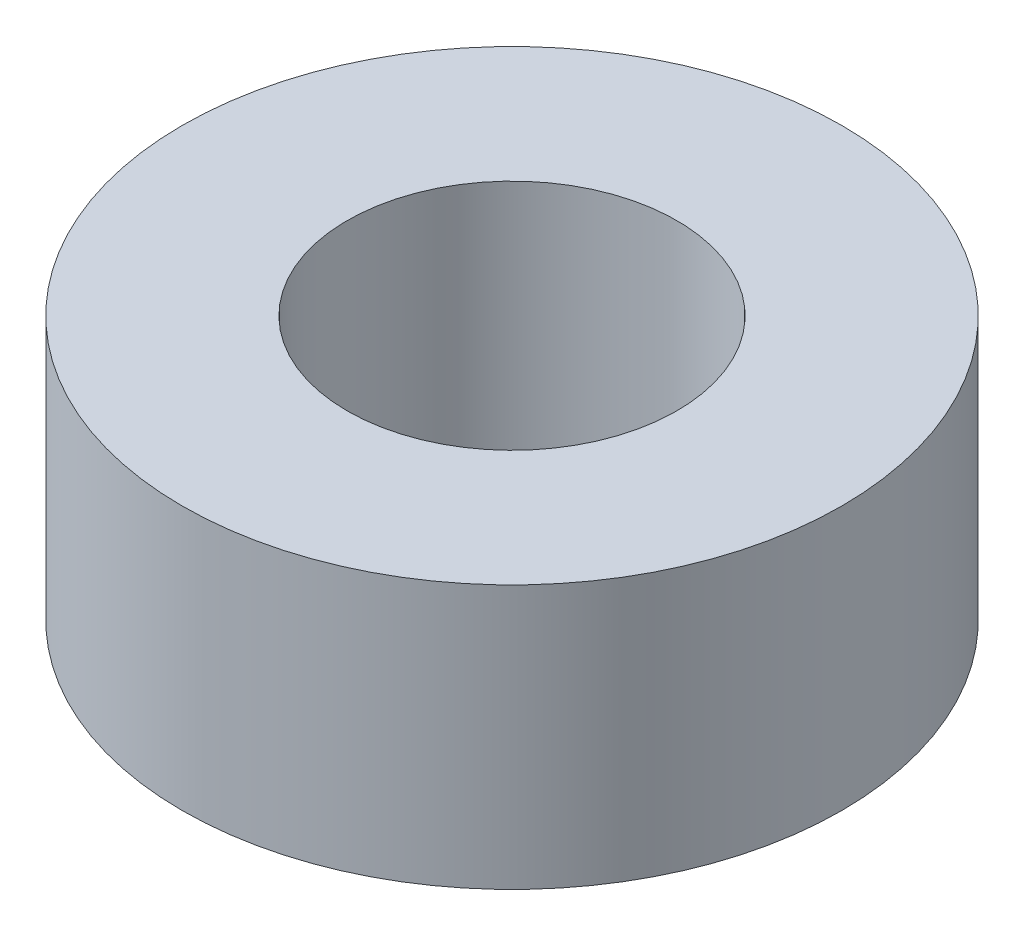
ISO-10303-21;
HEADER;
FILE_DESCRIPTION(('STEP AP214'),'2;1');
FILE_NAME('part.step','',(''),(''),'','','');
FILE_SCHEMA(('AUTOMOTIVE_DESIGN { 1 0 10303 214 1 1 1 1 }'));
ENDSEC;
DATA;
#1=APPLICATION_CONTEXT('core data for automotive mechanical design processes');
#2=APPLICATION_PROTOCOL_DEFINITION('international standard','automotive_design',2000,#1);
#3=PRODUCT_CONTEXT('',#1,'mechanical');
#4=PRODUCT('Part','Part','',(#3));
#5=PRODUCT_RELATED_PRODUCT_CATEGORY('part','',(#4));
#6=PRODUCT_DEFINITION_FORMATION('','',#4);
#7=PRODUCT_DEFINITION_CONTEXT('part definition',#1,'design');
#8=PRODUCT_DEFINITION('design','',#6,#7);
#9=PRODUCT_DEFINITION_SHAPE('','',#8);
#10=(LENGTH_UNIT() NAMED_UNIT(*) SI_UNIT(.MILLI.,.METRE.));
#11=(NAMED_UNIT(*) PLANE_ANGLE_UNIT() SI_UNIT($,.RADIAN.));
#12=(NAMED_UNIT(*) SI_UNIT($,.STERADIAN.) SOLID_ANGLE_UNIT());
#13=UNCERTAINTY_MEASURE_WITH_UNIT(LENGTH_MEASURE(1.E-05),#10,'distance_accuracy_value','');
#14=(GEOMETRIC_REPRESENTATION_CONTEXT(3) GLOBAL_UNCERTAINTY_ASSIGNED_CONTEXT((#13)) GLOBAL_UNIT_ASSIGNED_CONTEXT((#10,
#11,#12)) REPRESENTATION_CONTEXT('',''));
#15=CARTESIAN_POINT('',(0.,0.,0.));
#16=DIRECTION('',(0.,0.,1.));
#17=DIRECTION('',(1.,0.,0.));
#18=AXIS2_PLACEMENT_3D('',#15,#16,#17);
#19=CARTESIAN_POINT('',(0.,4.,0.));
#20=DIRECTION('',(0.,1.,0.));
#21=DIRECTION('',(0.,0.,1.));
#22=AXIS2_PLACEMENT_3D('',#19,#20,#21);
#23=PLANE('',#22);
#24=CARTESIAN_POINT('',(0.,4.,0.));
#25=DIRECTION('',(0.,1.,0.));
#26=DIRECTION('',(0.,0.,1.));
#27=AXIS2_PLACEMENT_3D('',#24,#25,#26);
#28=CIRCLE('',#27,5.);
#29=CARTESIAN_POINT('',(0.,4.,5.));
#30=VERTEX_POINT('',#29);
#31=EDGE_CURVE('E10',#30,#30,#28,.T.);
#32=ORIENTED_EDGE('',*,*,#31,.T.);
#33=EDGE_LOOP('',(#32));
#34=FACE_BOUND('',#33,.T.);
#35=CARTESIAN_POINT('',(0.,4.,0.));
#36=DIRECTION('',(0.,1.,0.));
#37=DIRECTION('',(0.,0.,1.));
#38=AXIS2_PLACEMENT_3D('',#35,#36,#37);
#39=CIRCLE('',#38,2.5);
#40=CARTESIAN_POINT('',(0.,4.,2.5));
#41=VERTEX_POINT('',#40);
#42=EDGE_CURVE('E42',#41,#41,#39,.T.);
#43=ORIENTED_EDGE('',*,*,#42,.F.);
#44=EDGE_LOOP('',(#43));
#45=FACE_BOUND('',#44,.T.);
#46=ADVANCED_FACE('F31',(#34,#45),#23,.T.);
#47=CARTESIAN_POINT('',(0.,0.,0.));
#48=DIRECTION('',(0.,1.,0.));
#49=DIRECTION('',(0.,0.,1.));
#50=AXIS2_PLACEMENT_3D('',#47,#48,#49);
#51=PLANE('',#50);
#52=CARTESIAN_POINT('',(0.,0.,0.));
#53=DIRECTION('',(0.,1.,0.));
#54=DIRECTION('',(0.,0.,1.));
#55=AXIS2_PLACEMENT_3D('',#52,#53,#54);
#56=CIRCLE('',#55,5.);
#57=CARTESIAN_POINT('',(0.,0.,5.));
#58=VERTEX_POINT('',#57);
#59=EDGE_CURVE('E35',#58,#58,#56,.T.);
#60=ORIENTED_EDGE('',*,*,#59,.F.);
#61=EDGE_LOOP('',(#60));
#62=FACE_BOUND('',#61,.T.);
#63=CARTESIAN_POINT('',(0.,0.,0.));
#64=DIRECTION('',(0.,1.,0.));
#65=DIRECTION('',(0.,0.,1.));
#66=AXIS2_PLACEMENT_3D('',#63,#64,#65);
#67=CIRCLE('',#66,2.5);
#68=CARTESIAN_POINT('',(0.,0.,2.5));
#69=VERTEX_POINT('',#68);
#70=EDGE_CURVE('E44',#69,#69,#67,.T.);
#71=ORIENTED_EDGE('',*,*,#70,.T.);
#72=EDGE_LOOP('',(#71));
#73=FACE_BOUND('',#72,.T.);
#74=ADVANCED_FACE('F54',(#62,#73),#51,.F.);
#75=CARTESIAN_POINT('',(0.,4.,0.));
#76=DIRECTION('',(0.,-1.,0.));
#77=DIRECTION('',(0.,0.,-1.));
#78=AXIS2_PLACEMENT_3D('',#75,#76,#77);
#79=CYLINDRICAL_SURFACE('',#78,5.);
#80=ORIENTED_EDGE('',*,*,#31,.F.);
#81=EDGE_LOOP('',(#80));
#82=FACE_BOUND('',#81,.T.);
#83=ORIENTED_EDGE('',*,*,#59,.T.);
#84=EDGE_LOOP('',(#83));
#85=FACE_BOUND('',#84,.T.);
#86=ADVANCED_FACE('F33',(#82,#85),#79,.T.);
#87=CARTESIAN_POINT('',(0.,4.,0.));
#88=DIRECTION('',(0.,-1.,0.));
#89=DIRECTION('',(0.,0.,-1.));
#90=AXIS2_PLACEMENT_3D('',#87,#88,#89);
#91=CYLINDRICAL_SURFACE('',#90,2.5);
#92=ORIENTED_EDGE('',*,*,#42,.T.);
#93=EDGE_LOOP('',(#92));
#94=FACE_BOUND('',#93,.T.);
#95=ORIENTED_EDGE('',*,*,#70,.F.);
#96=EDGE_LOOP('',(#95));
#97=FACE_BOUND('',#96,.T.);
#98=ADVANCED_FACE('F50',(#94,#97),#91,.F.);
#99=CLOSED_SHELL('',(#46,#74,#86,#98));
#100=MANIFOLD_SOLID_BREP('B2',#99);
#101=ADVANCED_BREP_SHAPE_REPRESENTATION('',(#18,#100),#14);
#102=SHAPE_DEFINITION_REPRESENTATION(#9,#101);
ENDSEC;
END-ISO-10303-21;
